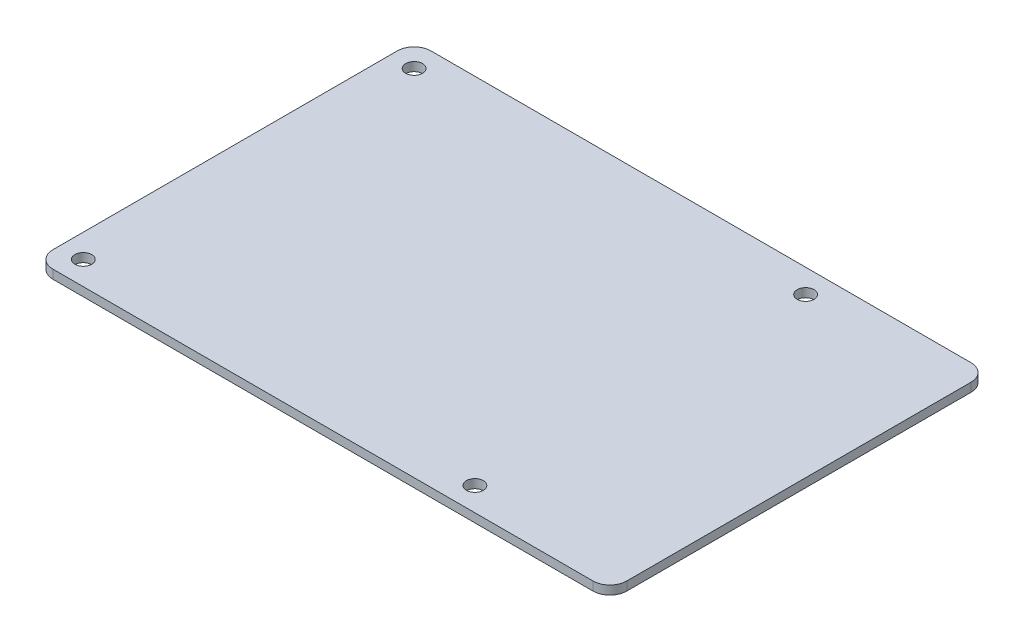
ISO-10303-21;
HEADER;
FILE_DESCRIPTION(('STEP AP214'),'2;1');
FILE_NAME('part.step','',(''),(''),'','','');
FILE_SCHEMA(('AUTOMOTIVE_DESIGN { 1 0 10303 214 1 1 1 1 }'));
ENDSEC;
DATA;
#1=APPLICATION_CONTEXT('core data for automotive mechanical design processes');
#2=APPLICATION_PROTOCOL_DEFINITION('international standard','automotive_design',2000,#1);
#3=PRODUCT_CONTEXT('',#1,'mechanical');
#4=PRODUCT('Part','Part','',(#3));
#5=PRODUCT_RELATED_PRODUCT_CATEGORY('part','',(#4));
#6=PRODUCT_DEFINITION_FORMATION('','',#4);
#7=PRODUCT_DEFINITION_CONTEXT('part definition',#1,'design');
#8=PRODUCT_DEFINITION('design','',#6,#7);
#9=PRODUCT_DEFINITION_SHAPE('','',#8);
#10=(LENGTH_UNIT() NAMED_UNIT(*) SI_UNIT(.MILLI.,.METRE.));
#11=(NAMED_UNIT(*) PLANE_ANGLE_UNIT() SI_UNIT($,.RADIAN.));
#12=(NAMED_UNIT(*) SI_UNIT($,.STERADIAN.) SOLID_ANGLE_UNIT());
#13=UNCERTAINTY_MEASURE_WITH_UNIT(LENGTH_MEASURE(1.E-05),#10,'distance_accuracy_value','');
#14=(GEOMETRIC_REPRESENTATION_CONTEXT(3) GLOBAL_UNCERTAINTY_ASSIGNED_CONTEXT((#13)) GLOBAL_UNIT_ASSIGNED_CONTEXT((#10,
#11,#12)) REPRESENTATION_CONTEXT('',''));
#15=CARTESIAN_POINT('',(0.,0.,0.));
#16=DIRECTION('',(0.,0.,1.));
#17=DIRECTION('',(1.,0.,0.));
#18=AXIS2_PLACEMENT_3D('',#15,#16,#17);
#19=CARTESIAN_POINT('',(-42.5000000000275,-8.74999999998325,6.25000000001675));
#20=DIRECTION('',(0.,-1.,0.));
#21=DIRECTION('',(0.,0.,-1.));
#22=AXIS2_PLACEMENT_3D('',#19,#20,#21);
#23=PLANE('',#22);
#24=DIRECTION('',(1.,0.,1.08002495835535E-12));
#25=VECTOR('',#24,1.);
#26=CARTESIAN_POINT('',(-40.0000000000302,-8.74999999998325,34.2499999999735));
#27=LINE('',#26,#25);
#28=CARTESIAN_POINT('',(-40.0000000000302,-8.74999999998325,34.2499999999735));
#29=VERTEX_POINT('',#28);
#30=CARTESIAN_POINT('',(39.9999999999698,-8.74999999998325,34.2500000000599));
#31=VERTEX_POINT('',#30);
#32=EDGE_CURVE('E49',#29,#31,#27,.T.);
#33=ORIENTED_EDGE('',*,*,#32,.F.);
#34=CARTESIAN_POINT('',(-40.0000000000275,-8.74999999998325,31.7499999999735));
#35=DIRECTION('',(0.,1.,0.));
#36=DIRECTION('',(-1.08002495835535E-12,0.,1.));
#37=AXIS2_PLACEMENT_3D('',#34,#35,#36);
#38=CIRCLE('',#37,2.5);
#39=CARTESIAN_POINT('',(-42.5000000000275,-8.74999999998325,31.7499999999708));
#40=VERTEX_POINT('',#39);
#41=EDGE_CURVE('E229',#40,#29,#38,.T.);
#42=ORIENTED_EDGE('',*,*,#41,.F.);
#43=DIRECTION('',(-1.07835309309474E-12,0.,1.));
#44=VECTOR('',#43,1.);
#45=CARTESIAN_POINT('',(-42.4999999999725,-8.74999999998325,-19.2500000000291));
#46=LINE('',#45,#44);
#47=CARTESIAN_POINT('',(-42.4999999999725,-8.74999999998325,-19.2500000000291));
#48=VERTEX_POINT('',#47);
#49=EDGE_CURVE('E102',#48,#40,#46,.T.);
#50=ORIENTED_EDGE('',*,*,#49,.F.);
#51=CARTESIAN_POINT('',(-39.9999999999724,-8.74999999998325,-19.2500000000263));
#52=DIRECTION('',(0.,1.,0.));
#53=DIRECTION('',(-1.,0.,-1.1386447340555E-12));
#54=AXIS2_PLACEMENT_3D('',#51,#52,#53);
#55=CIRCLE('',#54,2.50000000000014);
#56=CARTESIAN_POINT('',(-39.9999999999698,-8.74999999998325,-21.7500000000264));
#57=VERTEX_POINT('',#56);
#58=EDGE_CURVE('E110',#57,#48,#55,.T.);
#59=ORIENTED_EDGE('',*,*,#58,.F.);
#60=DIRECTION('',(-1.,0.,-1.0786926907258E-12));
#61=VECTOR('',#60,1.);
#62=CARTESIAN_POINT('',(40.0000000000302,-8.74999999998325,-21.7499999999401));
#63=LINE('',#62,#61);
#64=CARTESIAN_POINT('',(40.0000000000302,-8.74999999998325,-21.7499999999401));
#65=VERTEX_POINT('',#64);
#66=EDGE_CURVE('E276',#65,#57,#63,.T.);
#67=ORIENTED_EDGE('',*,*,#66,.F.);
#68=CARTESIAN_POINT('',(40.0000000000275,-8.74999999998325,-19.2499999999401));
#69=DIRECTION('',(0.,1.,0.));
#70=DIRECTION('',(1.07647224467656E-12,0.,-1.));
#71=AXIS2_PLACEMENT_3D('',#68,#69,#70);
#72=CIRCLE('',#71,2.5);
#73=CARTESIAN_POINT('',(42.5000000000275,-8.74999999998325,-19.2499999999374));
#74=VERTEX_POINT('',#73);
#75=EDGE_CURVE('E275',#74,#65,#72,.T.);
#76=ORIENTED_EDGE('',*,*,#75,.F.);
#77=DIRECTION('',(1.07835309309474E-12,0.,-1.));
#78=VECTOR('',#77,1.);
#79=CARTESIAN_POINT('',(42.4999999999725,-8.74999999998325,31.7500000000626));
#80=LINE('',#79,#78);
#81=CARTESIAN_POINT('',(42.4999999999725,-8.74999999998325,31.7500000000626));
#82=VERTEX_POINT('',#81);
#83=EDGE_CURVE('E313',#82,#74,#80,.T.);
#84=ORIENTED_EDGE('',*,*,#83,.F.);
#85=CARTESIAN_POINT('',(39.9999999999725,-8.74999999998325,31.7500000000599));
#86=DIRECTION('',(0.,1.,0.));
#87=DIRECTION('',(1.,0.,1.09956488358873E-12));
#88=AXIS2_PLACEMENT_3D('',#85,#86,#87);
#89=CIRCLE('',#88,2.50000000000005);
#90=EDGE_CURVE('E28',#31,#82,#89,.T.);
#91=ORIENTED_EDGE('',*,*,#90,.F.);
#92=EDGE_LOOP('',(#33,#42,#50,#59,#67,#76,#84,#91));
#93=FACE_BOUND('',#92,.T.);
#94=CARTESIAN_POINT('',(-38.999999999987,-8.74999999998325,-18.2500000000388));
#95=DIRECTION('',(0.,1.,0.));
#96=DIRECTION('',(0.,0.,1.));
#97=AXIS2_PLACEMENT_3D('',#94,#95,#96);
#98=CIRCLE('',#97,1.2499999999866);
#99=CARTESIAN_POINT('',(-38.999999999987,-8.74999999998325,-19.5000000000254));
#100=VERTEX_POINT('',#99);
#101=CARTESIAN_POINT('',(-37.75,-8.74999999998325,-18.250000000068));
#102=VERTEX_POINT('',#101);
#103=EDGE_CURVE('E13',#100,#102,#98,.T.);
#104=ORIENTED_EDGE('',*,*,#103,.T.);
#105=CARTESIAN_POINT('',(-38.999999999987,-8.74999999998325,-18.2500000000388));
#106=DIRECTION('',(0.,1.,0.));
#107=DIRECTION('',(0.,0.,1.));
#108=AXIS2_PLACEMENT_3D('',#105,#106,#107);
#109=CIRCLE('',#108,1.2499999999866);
#110=EDGE_CURVE('E35',#102,#100,#109,.T.);
#111=ORIENTED_EDGE('',*,*,#110,.T.);
#112=EDGE_LOOP('',(#104,#111));
#113=FACE_BOUND('',#112,.T.);
#114=CARTESIAN_POINT('',(-39.0000000000399,-8.74999999998325,30.7499999999471));
#115=DIRECTION('',(0.,1.,0.));
#116=DIRECTION('',(0.,0.,1.));
#117=AXIS2_PLACEMENT_3D('',#114,#115,#116);
#118=CIRCLE('',#117,1.24999999998655);
#119=CARTESIAN_POINT('',(-39.0000000000399,-8.74999999998326,29.4999999999606));
#120=VERTEX_POINT('',#119);
#121=CARTESIAN_POINT('',(-37.7500000000531,-8.74999999998325,30.7499999999179));
#122=VERTEX_POINT('',#121);
#123=EDGE_CURVE('E234',#120,#122,#118,.T.);
#124=ORIENTED_EDGE('',*,*,#123,.T.);
#125=CARTESIAN_POINT('',(-39.0000000000399,-8.74999999998325,30.7499999999471));
#126=DIRECTION('',(0.,1.,0.));
#127=DIRECTION('',(0.,0.,1.));
#128=AXIS2_PLACEMENT_3D('',#125,#126,#127);
#129=CIRCLE('',#128,1.24999999998655);
#130=EDGE_CURVE('E230',#122,#120,#129,.T.);
#131=ORIENTED_EDGE('',*,*,#130,.T.);
#132=EDGE_LOOP('',(#124,#131));
#133=FACE_BOUND('',#132,.T.);
#134=CARTESIAN_POINT('',(18.9999999999602,-8.74999999998325,30.7500000000098));
#135=DIRECTION('',(0.,1.,0.));
#136=DIRECTION('',(0.,0.,1.));
#137=AXIS2_PLACEMENT_3D('',#134,#135,#136);
#138=CIRCLE('',#137,1.24999999998655);
#139=CARTESIAN_POINT('',(18.9999999999601,-8.74999999998326,29.5000000000232));
#140=VERTEX_POINT('',#139);
#141=CARTESIAN_POINT('',(20.2499999999466,-8.74999999998325,30.7500000000097));
#142=VERTEX_POINT('',#141);
#143=EDGE_CURVE('E235',#140,#142,#138,.T.);
#144=ORIENTED_EDGE('',*,*,#143,.T.);
#145=CARTESIAN_POINT('',(18.9999999999602,-8.74999999998325,30.7500000000098));
#146=DIRECTION('',(0.,1.,0.));
#147=DIRECTION('',(0.,0.,1.));
#148=AXIS2_PLACEMENT_3D('',#145,#146,#147);
#149=CIRCLE('',#148,1.24999999998655);
#150=EDGE_CURVE('E241',#142,#140,#149,.T.);
#151=ORIENTED_EDGE('',*,*,#150,.T.);
#152=EDGE_LOOP('',(#144,#151));
#153=FACE_BOUND('',#152,.T.);
#154=CARTESIAN_POINT('',(19.0000000000129,-8.74999999998325,-18.2499999999763));
#155=DIRECTION('',(0.,1.,0.));
#156=DIRECTION('',(0.,0.,-1.));
#157=AXIS2_PLACEMENT_3D('',#154,#155,#156);
#158=CIRCLE('',#157,1.24999999998655);
#159=CARTESIAN_POINT('',(19.000000000013,-8.74999999998325,-16.9999999999897));
#160=VERTEX_POINT('',#159);
#161=CARTESIAN_POINT('',(17.7500000000265,-8.74999999998325,-18.2499999999763));
#162=VERTEX_POINT('',#161);
#163=EDGE_CURVE('E225',#160,#162,#158,.T.);
#164=ORIENTED_EDGE('',*,*,#163,.T.);
#165=CARTESIAN_POINT('',(19.0000000000129,-8.74999999998325,-18.2499999999763));
#166=DIRECTION('',(0.,1.,0.));
#167=DIRECTION('',(0.,0.,-1.));
#168=AXIS2_PLACEMENT_3D('',#165,#166,#167);
#169=CIRCLE('',#168,1.24999999998655);
#170=EDGE_CURVE('E221',#162,#160,#169,.T.);
#171=ORIENTED_EDGE('',*,*,#170,.T.);
#172=EDGE_LOOP('',(#164,#171));
#173=FACE_BOUND('',#172,.T.);
#174=ADVANCED_FACE('F24',(#93,#113,#133,#153,#173),#23,.T.);
#175=CARTESIAN_POINT('',(19.000000000013,-8.74999999998325,-18.2499999999763));
#176=DIRECTION('',(0.,1.,0.));
#177=DIRECTION('',(1.,0.,0.));
#178=AXIS2_PLACEMENT_3D('',#175,#176,#177);
#179=CYLINDRICAL_SURFACE('',#178,1.2499999999865);
#180=CARTESIAN_POINT('',(19.0000000000129,-7.44999999998325,-18.2499999999763));
#181=DIRECTION('',(0.,1.,0.));
#182=DIRECTION('',(0.,0.,-1.));
#183=AXIS2_PLACEMENT_3D('',#180,#181,#182);
#184=CIRCLE('',#183,1.24999999998655);
#185=CARTESIAN_POINT('',(19.000000000013,-7.44999999998325,-16.9999999999897));
#186=VERTEX_POINT('',#185);
#187=CARTESIAN_POINT('',(17.7500000000265,-7.44999999998325,-18.2499999999763));
#188=VERTEX_POINT('',#187);
#189=EDGE_CURVE('E226',#186,#188,#184,.T.);
#190=ORIENTED_EDGE('',*,*,#189,.T.);
#191=DIRECTION('',(0.,-1.,0.));
#192=VECTOR('',#191,1.);
#193=CARTESIAN_POINT('',(17.7500000000265,-8.74999999998325,-18.2499999999763));
#194=LINE('',#193,#192);
#195=EDGE_CURVE('E332',#188,#162,#194,.T.);
#196=ORIENTED_EDGE('',*,*,#195,.T.);
#197=ORIENTED_EDGE('',*,*,#163,.F.);
#198=ORIENTED_EDGE('',*,*,#170,.F.);
#199=ORIENTED_EDGE('',*,*,#195,.F.);
#200=CARTESIAN_POINT('',(19.0000000000129,-7.44999999998325,-18.2499999999763));
#201=DIRECTION('',(0.,1.,0.));
#202=DIRECTION('',(0.,0.,-1.));
#203=AXIS2_PLACEMENT_3D('',#200,#201,#202);
#204=CIRCLE('',#203,1.24999999998655);
#205=EDGE_CURVE('E285',#188,#186,#204,.T.);
#206=ORIENTED_EDGE('',*,*,#205,.T.);
#207=EDGE_LOOP('',(#190,#196,#197,#198,#199,#206));
#208=FACE_BOUND('',#207,.T.);
#209=ADVANCED_FACE('F435',(#208),#179,.F.);
#210=CARTESIAN_POINT('',(0.,-7.44999999998325,34.2500000000599));
#211=DIRECTION('',(0.,1.,0.));
#212=DIRECTION('',(1.,0.,0.));
#213=AXIS2_PLACEMENT_3D('',#210,#211,#212);
#214=PLANE('',#213);
#215=DIRECTION('',(1.,0.,1.08002495835535E-12));
#216=VECTOR('',#215,1.);
#217=CARTESIAN_POINT('',(-40.0000000000302,-7.44999999998325,34.2499999999735));
#218=LINE('',#217,#216);
#219=CARTESIAN_POINT('',(-40.0000000000302,-7.44999999998325,34.2499999999735));
#220=VERTEX_POINT('',#219);
#221=CARTESIAN_POINT('',(39.9999999999698,-7.44999999998325,34.2500000000599));
#222=VERTEX_POINT('',#221);
#223=EDGE_CURVE('E250',#220,#222,#218,.T.);
#224=ORIENTED_EDGE('',*,*,#223,.T.);
#225=CARTESIAN_POINT('',(39.9999999999702,-7.44999999998325,31.7500000000576));
#226=DIRECTION('',(0.,1.,0.));
#227=DIRECTION('',(0.999999851559693,0.,0.000544867498916303));
#228=AXIS2_PLACEMENT_3D('',#225,#226,#227);
#229=CIRCLE('',#228,2.50000000000229);
#230=CARTESIAN_POINT('',(42.4999999999725,-7.44999999998325,31.7500004097057));
#231=VERTEX_POINT('',#230);
#232=EDGE_CURVE('E246',#222,#231,#229,.T.);
#233=ORIENTED_EDGE('',*,*,#232,.T.);
#234=DIRECTION('',(1.07835309309474E-12,0.,-1.));
#235=VECTOR('',#234,1.);
#236=CARTESIAN_POINT('',(42.4999999999725,-7.44999999998325,31.7500000000626));
#237=LINE('',#236,#235);
#238=CARTESIAN_POINT('',(42.5000000000275,-7.44999999998325,-19.2499999999374));
#239=VERTEX_POINT('',#238);
#240=EDGE_CURVE('E251',#231,#239,#237,.T.);
#241=ORIENTED_EDGE('',*,*,#240,.T.);
#242=CARTESIAN_POINT('',(40.0000000000275,-7.44999999998325,-19.2499999999401));
#243=DIRECTION('',(0.,1.,0.));
#244=DIRECTION('',(1.07647224467656E-12,0.,-1.));
#245=AXIS2_PLACEMENT_3D('',#242,#243,#244);
#246=CIRCLE('',#245,2.5);
#247=CARTESIAN_POINT('',(40.0000000000302,-7.44999999998325,-21.7499999999401));
#248=VERTEX_POINT('',#247);
#249=EDGE_CURVE('E260',#239,#248,#246,.T.);
#250=ORIENTED_EDGE('',*,*,#249,.T.);
#251=DIRECTION('',(-1.,0.,-1.0786926907258E-12));
#252=VECTOR('',#251,1.);
#253=CARTESIAN_POINT('',(40.0000000000302,-7.44999999998325,-21.7499999999401));
#254=LINE('',#253,#252);
#255=CARTESIAN_POINT('',(-39.9999999999698,-7.44999999998325,-21.7500000000264));
#256=VERTEX_POINT('',#255);
#257=EDGE_CURVE('E238',#248,#256,#254,.T.);
#258=ORIENTED_EDGE('',*,*,#257,.T.);
#259=CARTESIAN_POINT('',(-39.9999999999724,-7.44999999998325,-19.2500000000263));
#260=DIRECTION('',(0.,1.,0.));
#261=DIRECTION('',(-1.,0.,-1.1386447340555E-12));
#262=AXIS2_PLACEMENT_3D('',#259,#260,#261);
#263=CIRCLE('',#262,2.50000000000014);
#264=CARTESIAN_POINT('',(-42.4999999999725,-7.44999999998325,-19.2500000000291));
#265=VERTEX_POINT('',#264);
#266=EDGE_CURVE('E195',#256,#265,#263,.T.);
#267=ORIENTED_EDGE('',*,*,#266,.T.);
#268=DIRECTION('',(-1.07835309309474E-12,0.,1.));
#269=VECTOR('',#268,1.);
#270=CARTESIAN_POINT('',(-42.4999999999725,-7.44999999998325,-19.2500000000291));
#271=LINE('',#270,#269);
#272=CARTESIAN_POINT('',(-42.5000000000275,-7.44999999998325,31.7499999999708));
#273=VERTEX_POINT('',#272);
#274=EDGE_CURVE('E188',#265,#273,#271,.T.);
#275=ORIENTED_EDGE('',*,*,#274,.T.);
#276=CARTESIAN_POINT('',(-40.0000000000275,-7.44999999998325,31.7499999999735));
#277=DIRECTION('',(0.,1.,0.));
#278=DIRECTION('',(-1.08002495835535E-12,0.,1.));
#279=AXIS2_PLACEMENT_3D('',#276,#277,#278);
#280=CIRCLE('',#279,2.5);
#281=EDGE_CURVE('E177',#273,#220,#280,.T.);
#282=ORIENTED_EDGE('',*,*,#281,.T.);
#283=EDGE_LOOP('',(#224,#233,#241,#250,#258,#267,#275,#282));
#284=FACE_BOUND('',#283,.T.);
#285=CARTESIAN_POINT('',(-38.999999999987,-7.44999999998325,-18.2500000000388));
#286=DIRECTION('',(0.,1.,0.));
#287=DIRECTION('',(0.,0.,1.));
#288=AXIS2_PLACEMENT_3D('',#285,#286,#287);
#289=CIRCLE('',#288,1.2499999999866);
#290=CARTESIAN_POINT('',(-38.999999999987,-7.44999999998325,-19.5000000000254));
#291=VERTEX_POINT('',#290);
#292=CARTESIAN_POINT('',(-37.75,-7.44999999998325,-18.250000000068));
#293=VERTEX_POINT('',#292);
#294=EDGE_CURVE('E267',#291,#293,#289,.T.);
#295=ORIENTED_EDGE('',*,*,#294,.F.);
#296=CARTESIAN_POINT('',(-38.999999999987,-7.44999999998325,-18.2500000000388));
#297=DIRECTION('',(0.,1.,0.));
#298=DIRECTION('',(0.,0.,1.));
#299=AXIS2_PLACEMENT_3D('',#296,#297,#298);
#300=CIRCLE('',#299,1.2499999999866);
#301=EDGE_CURVE('E308',#293,#291,#300,.T.);
#302=ORIENTED_EDGE('',*,*,#301,.F.);
#303=EDGE_LOOP('',(#295,#302));
#304=FACE_BOUND('',#303,.T.);
#305=CARTESIAN_POINT('',(-39.0000000000399,-7.44999999998325,30.7499999999471));
#306=DIRECTION('',(0.,1.,0.));
#307=DIRECTION('',(0.,0.,1.));
#308=AXIS2_PLACEMENT_3D('',#305,#306,#307);
#309=CIRCLE('',#308,1.24999999998655);
#310=CARTESIAN_POINT('',(-39.0000000000399,-7.44999999998326,29.4999999999606));
#311=VERTEX_POINT('',#310);
#312=CARTESIAN_POINT('',(-37.7500000000531,-7.44999999998325,30.7499999999179));
#313=VERTEX_POINT('',#312);
#314=EDGE_CURVE('E256',#311,#313,#309,.T.);
#315=ORIENTED_EDGE('',*,*,#314,.F.);
#316=CARTESIAN_POINT('',(-39.0000000000399,-7.44999999998325,30.7499999999471));
#317=DIRECTION('',(0.,1.,0.));
#318=DIRECTION('',(0.,0.,1.));
#319=AXIS2_PLACEMENT_3D('',#316,#317,#318);
#320=CIRCLE('',#319,1.24999999998655);
#321=EDGE_CURVE('E257',#313,#311,#320,.T.);
#322=ORIENTED_EDGE('',*,*,#321,.F.);
#323=EDGE_LOOP('',(#315,#322));
#324=FACE_BOUND('',#323,.T.);
#325=CARTESIAN_POINT('',(18.9999999999602,-7.44999999998325,30.7500000000098));
#326=DIRECTION('',(0.,1.,0.));
#327=DIRECTION('',(0.,0.,1.));
#328=AXIS2_PLACEMENT_3D('',#325,#326,#327);
#329=CIRCLE('',#328,1.24999999998655);
#330=CARTESIAN_POINT('',(18.9999999999601,-7.44999999998326,29.5000000000232));
#331=VERTEX_POINT('',#330);
#332=CARTESIAN_POINT('',(20.2499999999466,-7.44999999998325,30.7500000000097));
#333=VERTEX_POINT('',#332);
#334=EDGE_CURVE('E189',#331,#333,#329,.T.);
#335=ORIENTED_EDGE('',*,*,#334,.F.);
#336=CARTESIAN_POINT('',(18.9999999999602,-7.44999999998325,30.7500000000098));
#337=DIRECTION('',(0.,1.,0.));
#338=DIRECTION('',(0.,0.,1.));
#339=AXIS2_PLACEMENT_3D('',#336,#337,#338);
#340=CIRCLE('',#339,1.24999999998655);
#341=EDGE_CURVE('E220',#333,#331,#340,.T.);
#342=ORIENTED_EDGE('',*,*,#341,.F.);
#343=EDGE_LOOP('',(#335,#342));
#344=FACE_BOUND('',#343,.T.);
#345=ORIENTED_EDGE('',*,*,#189,.F.);
#346=ORIENTED_EDGE('',*,*,#205,.F.);
#347=EDGE_LOOP('',(#345,#346));
#348=FACE_BOUND('',#347,.T.);
#349=ADVANCED_FACE('F192',(#284,#304,#324,#344,#348),#214,.T.);
#350=CARTESIAN_POINT('',(18.9999999999601,-8.74999999998325,30.7500000000097));
#351=DIRECTION('',(0.,1.,0.));
#352=DIRECTION('',(-1.,0.,0.));
#353=AXIS2_PLACEMENT_3D('',#350,#351,#352);
#354=CYLINDRICAL_SURFACE('',#353,1.24999999998651);
#355=ORIENTED_EDGE('',*,*,#334,.T.);
#356=DIRECTION('',(0.,-1.,0.));
#357=VECTOR('',#356,1.);
#358=CARTESIAN_POINT('',(20.2499999999466,-8.74999999998325,30.7500000000097));
#359=LINE('',#358,#357);
#360=EDGE_CURVE('E216',#333,#142,#359,.T.);
#361=ORIENTED_EDGE('',*,*,#360,.T.);
#362=ORIENTED_EDGE('',*,*,#143,.F.);
#363=ORIENTED_EDGE('',*,*,#150,.F.);
#364=ORIENTED_EDGE('',*,*,#360,.F.);
#365=ORIENTED_EDGE('',*,*,#341,.T.);
#366=EDGE_LOOP('',(#355,#361,#362,#363,#364,#365));
#367=FACE_BOUND('',#366,.T.);
#368=ADVANCED_FACE('F417',(#367),#354,.F.);
#369=CARTESIAN_POINT('',(-39.0000000000397,-8.74999999998325,30.7499999999471));
#370=DIRECTION('',(0.,1.,0.));
#371=DIRECTION('',(-1.,0.,2.33768560067565E-11));
#372=AXIS2_PLACEMENT_3D('',#369,#370,#371);
#373=CYLINDRICAL_SURFACE('',#372,1.24999999998667);
#374=ORIENTED_EDGE('',*,*,#314,.T.);
#375=DIRECTION('',(0.,-1.,0.));
#376=VECTOR('',#375,1.);
#377=CARTESIAN_POINT('',(-37.7500000000531,-8.74999999998325,30.7499999999179));
#378=LINE('',#377,#376);
#379=EDGE_CURVE('E252',#313,#122,#378,.T.);
#380=ORIENTED_EDGE('',*,*,#379,.T.);
#381=ORIENTED_EDGE('',*,*,#123,.F.);
#382=ORIENTED_EDGE('',*,*,#130,.F.);
#383=ORIENTED_EDGE('',*,*,#379,.F.);
#384=ORIENTED_EDGE('',*,*,#321,.T.);
#385=EDGE_LOOP('',(#374,#380,#381,#382,#383,#384));
#386=FACE_BOUND('',#385,.T.);
#387=ADVANCED_FACE('F411',(#386),#373,.F.);
#388=CARTESIAN_POINT('',(-38.999999999987,-8.74999999998325,-18.2500000000388));
#389=DIRECTION('',(0.,1.,0.));
#390=DIRECTION('',(-1.,0.,2.33804087204368E-11));
#391=AXIS2_PLACEMENT_3D('',#388,#389,#390);
#392=CYLINDRICAL_SURFACE('',#391,1.2499999999866);
#393=ORIENTED_EDGE('',*,*,#294,.T.);
#394=DIRECTION('',(0.,-1.,0.));
#395=VECTOR('',#394,1.);
#396=CARTESIAN_POINT('',(-37.75,-8.74999999998325,-18.250000000068));
#397=LINE('',#396,#395);
#398=EDGE_CURVE('E312',#293,#102,#397,.T.);
#399=ORIENTED_EDGE('',*,*,#398,.T.);
#400=ORIENTED_EDGE('',*,*,#103,.F.);
#401=ORIENTED_EDGE('',*,*,#110,.F.);
#402=ORIENTED_EDGE('',*,*,#398,.F.);
#403=ORIENTED_EDGE('',*,*,#301,.T.);
#404=EDGE_LOOP('',(#393,#399,#400,#401,#402,#403));
#405=FACE_BOUND('',#404,.T.);
#406=ADVANCED_FACE('F416',(#405),#392,.F.);
#407=CARTESIAN_POINT('',(42.5,-8.74999999998325,6.2500000000626));
#408=DIRECTION('',(1.,0.,0.));
#409=DIRECTION('',(0.,-1.07835309309474E-12,1.));
#410=AXIS2_PLACEMENT_3D('',#407,#408,#409);
#411=PLANE('',#410);
#412=ORIENTED_EDGE('',*,*,#240,.F.);
#413=DIRECTION('',(0.,1.,0.));
#414=VECTOR('',#413,1.);
#415=CARTESIAN_POINT('',(42.4999999999725,-8.74999999998325,31.7500000000626));
#416=LINE('',#415,#414);
#417=EDGE_CURVE('E346',#82,#231,#416,.T.);
#418=ORIENTED_EDGE('',*,*,#417,.F.);
#419=ORIENTED_EDGE('',*,*,#83,.T.);
#420=DIRECTION('',(0.,1.,0.));
#421=VECTOR('',#420,1.);
#422=CARTESIAN_POINT('',(42.5000000000275,-8.74999999998325,-19.2499999999374));
#423=LINE('',#422,#421);
#424=EDGE_CURVE('E333',#74,#239,#423,.T.);
#425=ORIENTED_EDGE('',*,*,#424,.T.);
#426=EDGE_LOOP('',(#412,#418,#419,#425));
#427=FACE_BOUND('',#426,.T.);
#428=ADVANCED_FACE('F363',(#427),#411,.T.);
#429=CARTESIAN_POINT('',(40.0000000000275,-8.74999999998325,-19.2499999999401));
#430=DIRECTION('',(0.,-1.,0.));
#431=DIRECTION('',(0.707106781186548,0.,-0.707106781186548));
#432=AXIS2_PLACEMENT_3D('',#429,#430,#431);
#433=CYLINDRICAL_SURFACE('',#432,2.5);
#434=DIRECTION('',(0.,1.,0.));
#435=VECTOR('',#434,1.);
#436=CARTESIAN_POINT('',(40.0000000000302,-8.74999999998325,-21.7499999999401));
#437=LINE('',#436,#435);
#438=EDGE_CURVE('E214',#65,#248,#437,.T.);
#439=ORIENTED_EDGE('',*,*,#438,.T.);
#440=ORIENTED_EDGE('',*,*,#249,.F.);
#441=ORIENTED_EDGE('',*,*,#424,.F.);
#442=ORIENTED_EDGE('',*,*,#75,.T.);
#443=EDGE_LOOP('',(#439,#440,#441,#442));
#444=FACE_BOUND('',#443,.T.);
#445=ADVANCED_FACE('F26',(#444),#433,.T.);
#446=CARTESIAN_POINT('',(3.01980662698043E-11,-8.74999999998325,-21.7499999999833));
#447=DIRECTION('',(1.0786926907258E-12,0.,-1.));
#448=DIRECTION('',(0.,-1.,0.));
#449=AXIS2_PLACEMENT_3D('',#446,#447,#448);
#450=PLANE('',#449);
#451=DIRECTION('',(0.,1.,0.));
#452=VECTOR('',#451,1.);
#453=CARTESIAN_POINT('',(-39.9999999999698,-8.74999999998325,-21.7500000000264));
#454=LINE('',#453,#452);
#455=EDGE_CURVE('E271',#57,#256,#454,.T.);
#456=ORIENTED_EDGE('',*,*,#455,.T.);
#457=ORIENTED_EDGE('',*,*,#257,.F.);
#458=ORIENTED_EDGE('',*,*,#438,.F.);
#459=ORIENTED_EDGE('',*,*,#66,.T.);
#460=EDGE_LOOP('',(#456,#457,#458,#459));
#461=FACE_BOUND('',#460,.T.);
#462=ADVANCED_FACE('F429',(#461),#450,.T.);
#463=CARTESIAN_POINT('',(-39.9999999999723,-8.74999999998325,-19.2500000000262));
#464=DIRECTION('',(0.,-1.,0.));
#465=DIRECTION('',(-0.707106781186322,0.,-0.707106781186774));
#466=AXIS2_PLACEMENT_3D('',#463,#464,#465);
#467=CYLINDRICAL_SURFACE('',#466,2.50000000000025);
#468=DIRECTION('',(0.,1.,0.));
#469=VECTOR('',#468,1.);
#470=CARTESIAN_POINT('',(-42.4999999999725,-8.74999999998325,-19.2500000000291));
#471=LINE('',#470,#469);
#472=EDGE_CURVE('E209',#48,#265,#471,.T.);
#473=ORIENTED_EDGE('',*,*,#472,.T.);
#474=ORIENTED_EDGE('',*,*,#266,.F.);
#475=ORIENTED_EDGE('',*,*,#455,.F.);
#476=ORIENTED_EDGE('',*,*,#58,.T.);
#477=EDGE_LOOP('',(#473,#474,#475,#476));
#478=FACE_BOUND('',#477,.T.);
#479=ADVANCED_FACE('F424',(#478),#467,.T.);
#480=CARTESIAN_POINT('',(-42.5,-8.74999999998325,6.2499999999709));
#481=DIRECTION('',(-1.,0.,-1.07835309309474E-12));
#482=DIRECTION('',(-1.07835309309474E-12,0.,1.));
#483=AXIS2_PLACEMENT_3D('',#480,#481,#482);
#484=PLANE('',#483);
#485=DIRECTION('',(0.,1.,0.));
#486=VECTOR('',#485,1.);
#487=CARTESIAN_POINT('',(-42.5000000000275,-8.74999999998325,31.7499999999708));
#488=LINE('',#487,#486);
#489=EDGE_CURVE('E181',#40,#273,#488,.T.);
#490=ORIENTED_EDGE('',*,*,#489,.T.);
#491=ORIENTED_EDGE('',*,*,#274,.F.);
#492=ORIENTED_EDGE('',*,*,#472,.F.);
#493=ORIENTED_EDGE('',*,*,#49,.T.);
#494=EDGE_LOOP('',(#490,#491,#492,#493));
#495=FACE_BOUND('',#494,.T.);
#496=ADVANCED_FACE('F201',(#495),#484,.T.);
#497=CARTESIAN_POINT('',(-40.0000000000275,-8.74999999998325,31.7499999999735));
#498=DIRECTION('',(0.,-1.,0.));
#499=DIRECTION('',(-0.707106781186548,0.,0.707106781186548));
#500=AXIS2_PLACEMENT_3D('',#497,#498,#499);
#501=CYLINDRICAL_SURFACE('',#500,2.5);
#502=DIRECTION('',(0.,1.,0.));
#503=VECTOR('',#502,1.);
#504=CARTESIAN_POINT('',(-40.0000000000302,-8.74999999998325,34.2499999999735));
#505=LINE('',#504,#503);
#506=EDGE_CURVE('E183',#29,#220,#505,.T.);
#507=ORIENTED_EDGE('',*,*,#506,.T.);
#508=ORIENTED_EDGE('',*,*,#281,.F.);
#509=ORIENTED_EDGE('',*,*,#489,.F.);
#510=ORIENTED_EDGE('',*,*,#41,.T.);
#511=EDGE_LOOP('',(#507,#508,#509,#510));
#512=FACE_BOUND('',#511,.T.);
#513=ADVANCED_FACE('F179',(#512),#501,.T.);
#514=CARTESIAN_POINT('',(-3.02469160828878E-11,-8.74999999998325,34.2500000000167));
#515=DIRECTION('',(0.,0.,1.));
#516=DIRECTION('',(1.,1.08002495835535E-12,0.));
#517=AXIS2_PLACEMENT_3D('',#514,#515,#516);
#518=PLANE('',#517);
#519=DIRECTION('',(0.,1.,0.));
#520=VECTOR('',#519,1.);
#521=CARTESIAN_POINT('',(39.9999999999698,-8.74999999998325,34.2500000000599));
#522=LINE('',#521,#520);
#523=EDGE_CURVE('E245',#31,#222,#522,.T.);
#524=ORIENTED_EDGE('',*,*,#523,.T.);
#525=ORIENTED_EDGE('',*,*,#223,.F.);
#526=ORIENTED_EDGE('',*,*,#506,.F.);
#527=ORIENTED_EDGE('',*,*,#32,.T.);
#528=EDGE_LOOP('',(#524,#525,#526,#527));
#529=FACE_BOUND('',#528,.T.);
#530=ADVANCED_FACE('F355',(#529),#518,.T.);
#531=CARTESIAN_POINT('',(39.9999999999725,-8.74999999998325,31.7500000000599));
#532=DIRECTION('',(0.,-1.,0.));
#533=DIRECTION('',(0.707106781186548,0.,0.707106781186548));
#534=AXIS2_PLACEMENT_3D('',#531,#532,#533);
#535=CYLINDRICAL_SURFACE('',#534,2.5);
#536=ORIENTED_EDGE('',*,*,#417,.T.);
#537=ORIENTED_EDGE('',*,*,#232,.F.);
#538=ORIENTED_EDGE('',*,*,#523,.F.);
#539=ORIENTED_EDGE('',*,*,#90,.T.);
#540=EDGE_LOOP('',(#536,#537,#538,#539));
#541=FACE_BOUND('',#540,.T.);
#542=ADVANCED_FACE('F357',(#541),#535,.T.);
#543=CLOSED_SHELL('',(#174,#209,#349,#368,#387,#406,#428,#445,#462,#479,#496,#513,#530,#542));
#544=MANIFOLD_SOLID_BREP('B1',#543);
#545=ADVANCED_BREP_SHAPE_REPRESENTATION('',(#18,#544),#14);
#546=SHAPE_DEFINITION_REPRESENTATION(#9,#545);
ENDSEC;
END-ISO-10303-21;
